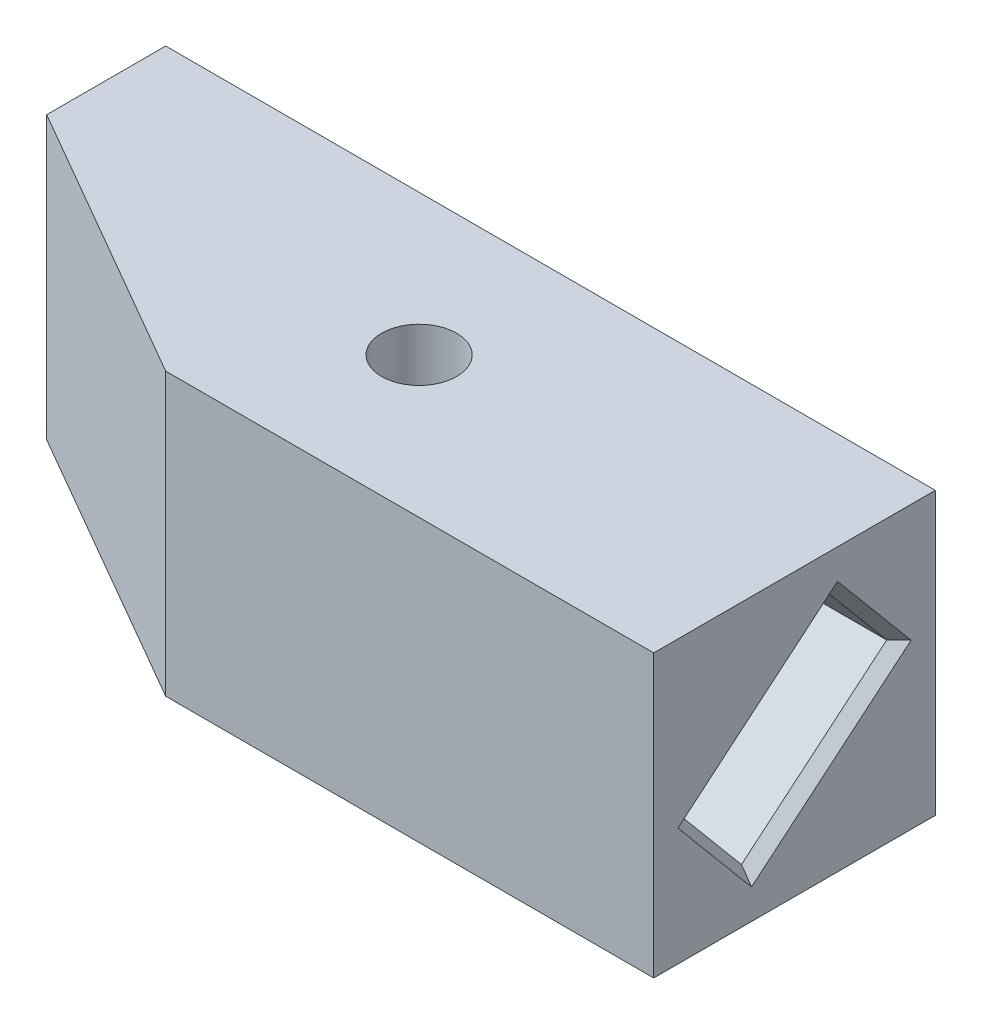
ISO-10303-21;
HEADER;
FILE_DESCRIPTION(('STEP AP214'),'2;1');
FILE_NAME('part.step','',(''),(''),'','','');
FILE_SCHEMA(('AUTOMOTIVE_DESIGN { 1 0 10303 214 1 1 1 1 }'));
ENDSEC;
DATA;
#1=APPLICATION_CONTEXT('core data for automotive mechanical design processes');
#2=APPLICATION_PROTOCOL_DEFINITION('international standard','automotive_design',2000,#1);
#3=PRODUCT_CONTEXT('',#1,'mechanical');
#4=PRODUCT('Part','Part','',(#3));
#5=PRODUCT_RELATED_PRODUCT_CATEGORY('part','',(#4));
#6=PRODUCT_DEFINITION_FORMATION('','',#4);
#7=PRODUCT_DEFINITION_CONTEXT('part definition',#1,'design');
#8=PRODUCT_DEFINITION('design','',#6,#7);
#9=PRODUCT_DEFINITION_SHAPE('','',#8);
#10=(LENGTH_UNIT() NAMED_UNIT(*) SI_UNIT(.MILLI.,.METRE.));
#11=(NAMED_UNIT(*) PLANE_ANGLE_UNIT() SI_UNIT($,.RADIAN.));
#12=(NAMED_UNIT(*) SI_UNIT($,.STERADIAN.) SOLID_ANGLE_UNIT());
#13=UNCERTAINTY_MEASURE_WITH_UNIT(LENGTH_MEASURE(1.E-05),#10,'distance_accuracy_value','');
#14=(GEOMETRIC_REPRESENTATION_CONTEXT(3) GLOBAL_UNCERTAINTY_ASSIGNED_CONTEXT((#13)) GLOBAL_UNIT_ASSIGNED_CONTEXT((#10,
#11,#12)) REPRESENTATION_CONTEXT('',''));
#15=CARTESIAN_POINT('',(0.,0.,0.));
#16=DIRECTION('',(0.,0.,1.));
#17=DIRECTION('',(1.,0.,0.));
#18=AXIS2_PLACEMENT_3D('',#15,#16,#17);
#19=CARTESIAN_POINT('',(20.,30.,15.));
#20=DIRECTION('',(-1.,0.,0.));
#21=DIRECTION('',(0.,0.,1.));
#22=AXIS2_PLACEMENT_3D('',#19,#20,#21);
#23=PLANE('',#22);
#24=DIRECTION('',(0.,-0.642787609686535,0.766044443118982));
#25=VECTOR('',#24,1.);
#26=CARTESIAN_POINT('',(20.,9.13870941688059,-2.50470123417735));
#27=LINE('',#26,#25);
#28=CARTESIAN_POINT('',(20.,17.4620713644947,-12.4240977377086));
#29=VERTEX_POINT('',#28);
#30=CARTESIAN_POINT('',(20.,3.19218642945365,4.58208889953283));
#31=VERTEX_POINT('',#30);
#32=EDGE_CURVE('E201',#29,#31,#27,.T.);
#33=ORIENTED_EDGE('',*,*,#32,.T.);
#34=DIRECTION('',(0.,0.766044443118982,0.642787609686535));
#35=VECTOR('',#34,1.);
#36=CARTESIAN_POINT('',(20.,24.0534770125731,22.0867901337102));
#37=LINE('',#36,#35);
#38=CARTESIAN_POINT('',(20.,12.5379286355053,12.4240977377086));
#39=VERTEX_POINT('',#38);
#40=EDGE_CURVE('E203',#31,#39,#37,.T.);
#41=ORIENTED_EDGE('',*,*,#40,.T.);
#42=DIRECTION('',(0.,0.642787609686535,-0.766044443118982));
#43=VECTOR('',#42,1.);
#44=CARTESIAN_POINT('',(20.,18.4844516229322,5.33730760399839));
#45=LINE('',#44,#43);
#46=CARTESIAN_POINT('',(20.,26.8078135705463,-4.58208889953283));
#47=VERTEX_POINT('',#46);
#48=EDGE_CURVE('E197',#39,#47,#45,.T.);
#49=ORIENTED_EDGE('',*,*,#48,.T.);
#50=DIRECTION('',(0.,-0.766044443118982,-0.642787609686535));
#51=VECTOR('',#50,1.);
#52=CARTESIAN_POINT('',(20.,38.3233619476141,5.08060349646879));
#53=LINE('',#52,#51);
#54=EDGE_CURVE('E199',#47,#29,#53,.T.);
#55=ORIENTED_EDGE('',*,*,#54,.T.);
#56=EDGE_LOOP('',(#33,#41,#49,#55));
#57=FACE_BOUND('',#56,.T.);
#58=DIRECTION('',(0.,0.,-1.));
#59=VECTOR('',#58,1.);
#60=CARTESIAN_POINT('',(20.,0.,15.));
#61=LINE('',#60,#59);
#62=CARTESIAN_POINT('',(20.,0.,15.));
#63=VERTEX_POINT('',#62);
#64=CARTESIAN_POINT('',(20.,0.,-15.));
#65=VERTEX_POINT('',#64);
#66=EDGE_CURVE('E172',#63,#65,#61,.T.);
#67=ORIENTED_EDGE('',*,*,#66,.T.);
#68=DIRECTION('',(0.,-1.,0.));
#69=VECTOR('',#68,1.);
#70=CARTESIAN_POINT('',(20.,30.,-15.));
#71=LINE('',#70,#69);
#72=CARTESIAN_POINT('',(20.,30.,-15.));
#73=VERTEX_POINT('',#72);
#74=EDGE_CURVE('E185',#73,#65,#71,.T.);
#75=ORIENTED_EDGE('',*,*,#74,.F.);
#76=DIRECTION('',(0.,0.,-1.));
#77=VECTOR('',#76,1.);
#78=CARTESIAN_POINT('',(20.,30.,15.));
#79=LINE('',#78,#77);
#80=CARTESIAN_POINT('',(20.,30.,15.));
#81=VERTEX_POINT('',#80);
#82=EDGE_CURVE('E135',#81,#73,#79,.T.);
#83=ORIENTED_EDGE('',*,*,#82,.F.);
#84=DIRECTION('',(0.,-1.,0.));
#85=VECTOR('',#84,1.);
#86=CARTESIAN_POINT('',(20.,30.,15.));
#87=LINE('',#86,#85);
#88=EDGE_CURVE('E178',#81,#63,#87,.T.);
#89=ORIENTED_EDGE('',*,*,#88,.T.);
#90=EDGE_LOOP('',(#67,#75,#83,#89));
#91=FACE_BOUND('',#90,.T.);
#92=ADVANCED_FACE('F35',(#57,#91),#23,.F.);
#93=CARTESIAN_POINT('',(-20.,30.,-15.));
#94=DIRECTION('',(0.,0.,1.));
#95=DIRECTION('',(1.,0.,0.));
#96=AXIS2_PLACEMENT_3D('',#93,#94,#95);
#97=PLANE('',#96);
#98=DIRECTION('',(-1.,0.,0.));
#99=VECTOR('',#98,1.);
#100=CARTESIAN_POINT('',(-20.,0.,-15.));
#101=LINE('',#100,#99);
#102=CARTESIAN_POINT('',(-62.,0.,-15.));
#103=VERTEX_POINT('',#102);
#104=EDGE_CURVE('E142',#65,#103,#101,.T.);
#105=ORIENTED_EDGE('',*,*,#104,.T.);
#106=DIRECTION('',(0.,-1.,0.));
#107=VECTOR('',#106,1.);
#108=CARTESIAN_POINT('',(-62.,0.,-15.));
#109=LINE('',#108,#107);
#110=CARTESIAN_POINT('',(-62.,30.,-15.));
#111=VERTEX_POINT('',#110);
#112=EDGE_CURVE('E125',#111,#103,#109,.T.);
#113=ORIENTED_EDGE('',*,*,#112,.F.);
#114=DIRECTION('',(-1.,0.,0.));
#115=VECTOR('',#114,1.);
#116=CARTESIAN_POINT('',(-20.,30.,-15.));
#117=LINE('',#116,#115);
#118=EDGE_CURVE('E132',#73,#111,#117,.T.);
#119=ORIENTED_EDGE('',*,*,#118,.F.);
#120=ORIENTED_EDGE('',*,*,#74,.T.);
#121=EDGE_LOOP('',(#105,#113,#119,#120));
#122=FACE_BOUND('',#121,.T.);
#123=ADVANCED_FACE('F141',(#122),#97,.F.);
#124=CARTESIAN_POINT('',(-20.,30.,15.));
#125=DIRECTION('',(0.,0.,-1.));
#126=DIRECTION('',(-1.,0.,0.));
#127=AXIS2_PLACEMENT_3D('',#124,#125,#126);
#128=PLANE('',#127);
#129=DIRECTION('',(1.,0.,0.));
#130=VECTOR('',#129,1.);
#131=CARTESIAN_POINT('',(-35.,30.,15.));
#132=LINE('',#131,#130);
#133=CARTESIAN_POINT('',(-31.9999999999998,30.,15.));
#134=VERTEX_POINT('',#133);
#135=EDGE_CURVE('E139',#134,#81,#132,.T.);
#136=ORIENTED_EDGE('',*,*,#135,.F.);
#137=DIRECTION('',(0.,-1.,0.));
#138=VECTOR('',#137,1.);
#139=CARTESIAN_POINT('',(-31.9999999999998,30.,15.));
#140=LINE('',#139,#138);
#141=CARTESIAN_POINT('',(-31.9999999999998,0.,15.));
#142=VERTEX_POINT('',#141);
#143=EDGE_CURVE('E190',#134,#142,#140,.T.);
#144=ORIENTED_EDGE('',*,*,#143,.T.);
#145=DIRECTION('',(1.,0.,0.));
#146=VECTOR('',#145,1.);
#147=CARTESIAN_POINT('',(-20.,0.,15.));
#148=LINE('',#147,#146);
#149=EDGE_CURVE('E175',#142,#63,#148,.T.);
#150=ORIENTED_EDGE('',*,*,#149,.T.);
#151=ORIENTED_EDGE('',*,*,#88,.F.);
#152=EDGE_LOOP('',(#136,#144,#150,#151));
#153=FACE_BOUND('',#152,.T.);
#154=ADVANCED_FACE('F261',(#153),#128,.F.);
#155=CARTESIAN_POINT('',(0.,30.,0.));
#156=DIRECTION('',(0.,-1.,0.));
#157=DIRECTION('',(0.,0.,-1.));
#158=AXIS2_PLACEMENT_3D('',#155,#156,#157);
#159=PLANE('',#158);
#160=CARTESIAN_POINT('',(-20.,30.,0.));
#161=DIRECTION('',(0.,1.,0.));
#162=DIRECTION('',(0.,0.,1.));
#163=AXIS2_PLACEMENT_3D('',#160,#161,#162);
#164=CIRCLE('',#163,4.);
#165=CARTESIAN_POINT('',(-20.,30.,4.));
#166=VERTEX_POINT('',#165);
#167=EDGE_CURVE('E162',#166,#166,#164,.T.);
#168=ORIENTED_EDGE('',*,*,#167,.F.);
#169=EDGE_LOOP('',(#168));
#170=FACE_BOUND('',#169,.T.);
#171=DIRECTION('',(0.,0.,-1.));
#172=VECTOR('',#171,1.);
#173=CARTESIAN_POINT('',(-62.,30.,-15.));
#174=LINE('',#173,#172);
#175=CARTESIAN_POINT('',(-62.,30.,-2.32050807568879));
#176=VERTEX_POINT('',#175);
#177=EDGE_CURVE('E120',#176,#111,#174,.T.);
#178=ORIENTED_EDGE('',*,*,#177,.F.);
#179=DIRECTION('',(-0.86602540378444,0.,-0.499999999999998));
#180=VECTOR('',#179,1.);
#181=CARTESIAN_POINT('',(-62.,30.,-2.32050807568879));
#182=LINE('',#181,#180);
#183=EDGE_CURVE('E188',#176,#134,#182,.F.);
#184=ORIENTED_EDGE('',*,*,#183,.T.);
#185=ORIENTED_EDGE('',*,*,#135,.T.);
#186=ORIENTED_EDGE('',*,*,#82,.T.);
#187=ORIENTED_EDGE('',*,*,#118,.T.);
#188=EDGE_LOOP('',(#178,#184,#185,#186,#187));
#189=FACE_BOUND('',#188,.T.);
#190=ADVANCED_FACE('F133',(#170,#189),#159,.F.);
#191=CARTESIAN_POINT('',(0.,0.,0.));
#192=DIRECTION('',(0.,-1.,0.));
#193=DIRECTION('',(0.,0.,-1.));
#194=AXIS2_PLACEMENT_3D('',#191,#192,#193);
#195=PLANE('',#194);
#196=CARTESIAN_POINT('',(-20.,0.,0.));
#197=DIRECTION('',(0.,1.,0.));
#198=DIRECTION('',(0.,0.,1.));
#199=AXIS2_PLACEMENT_3D('',#196,#197,#198);
#200=CIRCLE('',#199,4.);
#201=CARTESIAN_POINT('',(-20.,0.,4.));
#202=VERTEX_POINT('',#201);
#203=EDGE_CURVE('E169',#202,#202,#200,.T.);
#204=ORIENTED_EDGE('',*,*,#203,.T.);
#205=EDGE_LOOP('',(#204));
#206=FACE_BOUND('',#205,.T.);
#207=ORIENTED_EDGE('',*,*,#149,.F.);
#208=DIRECTION('',(0.86602540378444,0.,0.499999999999998));
#209=VECTOR('',#208,1.);
#210=CARTESIAN_POINT('',(-14.4951905283832,0.,25.1064064605509));
#211=LINE('',#210,#209);
#212=CARTESIAN_POINT('',(-62.,0.,-2.32050807568879));
#213=VERTEX_POINT('',#212);
#214=EDGE_CURVE('E192',#142,#213,#211,.F.);
#215=ORIENTED_EDGE('',*,*,#214,.T.);
#216=DIRECTION('',(0.,0.,1.));
#217=VECTOR('',#216,1.);
#218=CARTESIAN_POINT('',(-62.,0.,-15.));
#219=LINE('',#218,#217);
#220=EDGE_CURVE('E143',#103,#213,#219,.T.);
#221=ORIENTED_EDGE('',*,*,#220,.F.);
#222=ORIENTED_EDGE('',*,*,#104,.F.);
#223=ORIENTED_EDGE('',*,*,#66,.F.);
#224=EDGE_LOOP('',(#207,#215,#221,#222,#223));
#225=FACE_BOUND('',#224,.T.);
#226=ADVANCED_FACE('F325',(#206,#225),#195,.T.);
#227=CARTESIAN_POINT('',(-20.,0.,0.));
#228=DIRECTION('',(0.,1.,0.));
#229=DIRECTION('',(0.,0.,1.));
#230=AXIS2_PLACEMENT_3D('',#227,#228,#229);
#231=CYLINDRICAL_SURFACE('',#230,4.);
#232=ORIENTED_EDGE('',*,*,#203,.F.);
#233=EDGE_LOOP('',(#232));
#234=FACE_BOUND('',#233,.T.);
#235=ORIENTED_EDGE('',*,*,#167,.T.);
#236=EDGE_LOOP('',(#235));
#237=FACE_BOUND('',#236,.T.);
#238=ADVANCED_FACE('F252',(#234,#237),#231,.F.);
#239=CARTESIAN_POINT('',(-10.,25.3989815177408,-4.45883206610039));
#240=DIRECTION('',(0.,0.766044443118982,0.642787609686535));
#241=DIRECTION('',(0.,-0.642787609686535,0.766044443118982));
#242=AXIS2_PLACEMENT_3D('',#239,#240,#241);
#243=PLANE('',#242);
#244=DIRECTION('',(1.,0.,0.));
#245=VECTOR('',#244,1.);
#246=CARTESIAN_POINT('',(-10.,25.3989815177408,-4.45883206610039));
#247=LINE('',#246,#245);
#248=CARTESIAN_POINT('',(-10.,25.3989815177408,-4.45883206610039));
#249=VERTEX_POINT('',#248);
#250=CARTESIAN_POINT('',(18.8082464074058,25.3989815177408,-4.45883206610039));
#251=VERTEX_POINT('',#250);
#252=EDGE_CURVE('E160',#249,#251,#247,.T.);
#253=ORIENTED_EDGE('',*,*,#252,.T.);
#254=DIRECTION('',(0.,-0.642787609686535,0.766044443118982));
#255=VECTOR('',#254,1.);
#256=CARTESIAN_POINT('',(18.8082464074058,25.3989815177408,-4.45883206610039));
#257=LINE('',#256,#255);
#258=CARTESIAN_POINT('',(18.8082464074058,12.4146718020728,11.015265684903));
#259=VERTEX_POINT('',#258);
#260=EDGE_CURVE('E11',#251,#259,#257,.T.);
#261=ORIENTED_EDGE('',*,*,#260,.T.);
#262=DIRECTION('',(1.,0.,0.));
#263=VECTOR('',#262,1.);
#264=CARTESIAN_POINT('',(-10.,12.4146718020728,11.015265684903));
#265=LINE('',#264,#263);
#266=CARTESIAN_POINT('',(-10.,12.4146718020728,11.015265684903));
#267=VERTEX_POINT('',#266);
#268=EDGE_CURVE('E159',#267,#259,#265,.T.);
#269=ORIENTED_EDGE('',*,*,#268,.F.);
#270=DIRECTION('',(0.,-0.642787609686535,0.766044443118982));
#271=VECTOR('',#270,1.);
#272=CARTESIAN_POINT('',(-10.,25.3989815177408,-4.45883206610039));
#273=LINE('',#272,#271);
#274=EDGE_CURVE('E145',#249,#267,#273,.T.);
#275=ORIENTED_EDGE('',*,*,#274,.F.);
#276=EDGE_LOOP('',(#253,#261,#269,#275));
#277=FACE_BOUND('',#276,.T.);
#278=ADVANCED_FACE('F243',(#277),#243,.F.);
#279=CARTESIAN_POINT('',(-10.,17.5853281979272,-11.015265684903));
#280=DIRECTION('',(0.,0.642787609686535,-0.766044443118982));
#281=DIRECTION('',(0.,0.766044443118982,0.642787609686535));
#282=AXIS2_PLACEMENT_3D('',#279,#280,#281);
#283=PLANE('',#282);
#284=DIRECTION('',(1.,0.,0.));
#285=VECTOR('',#284,1.);
#286=CARTESIAN_POINT('',(-10.,17.5853281979272,-11.015265684903));
#287=LINE('',#286,#285);
#288=CARTESIAN_POINT('',(-10.,17.5853281979272,-11.015265684903));
#289=VERTEX_POINT('',#288);
#290=CARTESIAN_POINT('',(18.8082464074058,17.5853281979272,-11.015265684903));
#291=VERTEX_POINT('',#290);
#292=EDGE_CURVE('E163',#289,#291,#287,.T.);
#293=ORIENTED_EDGE('',*,*,#292,.T.);
#294=DIRECTION('',(0.,0.766044443118982,0.642787609686535));
#295=VECTOR('',#294,1.);
#296=CARTESIAN_POINT('',(18.8082464074058,17.5853281979272,-11.015265684903));
#297=LINE('',#296,#295);
#298=EDGE_CURVE('E44',#291,#251,#297,.T.);
#299=ORIENTED_EDGE('',*,*,#298,.T.);
#300=ORIENTED_EDGE('',*,*,#252,.F.);
#301=DIRECTION('',(0.,0.766044443118982,0.642787609686535));
#302=VECTOR('',#301,1.);
#303=CARTESIAN_POINT('',(-10.,17.5853281979272,-11.015265684903));
#304=LINE('',#303,#302);
#305=EDGE_CURVE('E156',#289,#249,#304,.T.);
#306=ORIENTED_EDGE('',*,*,#305,.F.);
#307=EDGE_LOOP('',(#293,#299,#300,#306));
#308=FACE_BOUND('',#307,.T.);
#309=ADVANCED_FACE('F244',(#308),#283,.F.);
#310=CARTESIAN_POINT('',(-10.,17.5853281979272,-11.015265684903));
#311=DIRECTION('',(0.,-0.766044443118982,-0.642787609686535));
#312=DIRECTION('',(0.,0.642787609686535,-0.766044443118982));
#313=AXIS2_PLACEMENT_3D('',#310,#311,#312);
#314=PLANE('',#313);
#315=DIRECTION('',(1.,0.,0.));
#316=VECTOR('',#315,1.);
#317=CARTESIAN_POINT('',(-10.,4.60101848225919,4.45883206610038));
#318=LINE('',#317,#316);
#319=CARTESIAN_POINT('',(-10.,4.60101848225919,4.45883206610038));
#320=VERTEX_POINT('',#319);
#321=CARTESIAN_POINT('',(18.8082464074058,4.60101848225919,4.45883206610038));
#322=VERTEX_POINT('',#321);
#323=EDGE_CURVE('E165',#320,#322,#318,.T.);
#324=ORIENTED_EDGE('',*,*,#323,.T.);
#325=DIRECTION('',(0.,0.642787609686535,-0.766044443118982));
#326=VECTOR('',#325,1.);
#327=CARTESIAN_POINT('',(18.8082464074058,17.5853281979272,-11.015265684903));
#328=LINE('',#327,#326);
#329=EDGE_CURVE('E59',#322,#291,#328,.T.);
#330=ORIENTED_EDGE('',*,*,#329,.T.);
#331=ORIENTED_EDGE('',*,*,#292,.F.);
#332=DIRECTION('',(0.,0.642787609686535,-0.766044443118982));
#333=VECTOR('',#332,1.);
#334=CARTESIAN_POINT('',(-10.,17.5853281979272,-11.015265684903));
#335=LINE('',#334,#333);
#336=EDGE_CURVE('E153',#320,#289,#335,.T.);
#337=ORIENTED_EDGE('',*,*,#336,.F.);
#338=EDGE_LOOP('',(#324,#330,#331,#337));
#339=FACE_BOUND('',#338,.T.);
#340=ADVANCED_FACE('F237',(#339),#314,.F.);
#341=CARTESIAN_POINT('',(-10.,4.60101848225919,4.45883206610038));
#342=DIRECTION('',(0.,-0.642787609686535,0.766044443118982));
#343=DIRECTION('',(0.,-0.766044443118982,-0.642787609686535));
#344=AXIS2_PLACEMENT_3D('',#341,#342,#343);
#345=PLANE('',#344);
#346=ORIENTED_EDGE('',*,*,#268,.T.);
#347=DIRECTION('',(0.,-0.766044443118982,-0.642787609686535));
#348=VECTOR('',#347,1.);
#349=CARTESIAN_POINT('',(18.8082464074058,4.60101848225919,4.45883206610038));
#350=LINE('',#349,#348);
#351=EDGE_CURVE('E194',#259,#322,#350,.T.);
#352=ORIENTED_EDGE('',*,*,#351,.T.);
#353=ORIENTED_EDGE('',*,*,#323,.F.);
#354=DIRECTION('',(0.,-0.766044443118982,-0.642787609686535));
#355=VECTOR('',#354,1.);
#356=CARTESIAN_POINT('',(-10.,4.60101848225919,4.45883206610038));
#357=LINE('',#356,#355);
#358=EDGE_CURVE('E150',#267,#320,#357,.T.);
#359=ORIENTED_EDGE('',*,*,#358,.F.);
#360=EDGE_LOOP('',(#346,#352,#353,#359));
#361=FACE_BOUND('',#360,.T.);
#362=ADVANCED_FACE('F234',(#361),#345,.F.);
#363=CARTESIAN_POINT('',(-10.,0.,0.));
#364=DIRECTION('',(-1.,0.,0.));
#365=DIRECTION('',(0.,0.,1.));
#366=AXIS2_PLACEMENT_3D('',#363,#364,#365);
#367=PLANE('',#366);
#368=ORIENTED_EDGE('',*,*,#274,.T.);
#369=ORIENTED_EDGE('',*,*,#358,.T.);
#370=ORIENTED_EDGE('',*,*,#336,.T.);
#371=ORIENTED_EDGE('',*,*,#305,.T.);
#372=EDGE_LOOP('',(#368,#369,#370,#371));
#373=FACE_BOUND('',#372,.T.);
#374=ADVANCED_FACE('F240',(#373),#367,.F.);
#375=CARTESIAN_POINT('',(-62.,0.,0.));
#376=DIRECTION('',(1.,0.,0.));
#377=DIRECTION('',(0.,0.,-1.));
#378=AXIS2_PLACEMENT_3D('',#375,#376,#377);
#379=PLANE('',#378);
#380=ORIENTED_EDGE('',*,*,#220,.T.);
#381=DIRECTION('',(0.,1.,0.));
#382=VECTOR('',#381,1.);
#383=CARTESIAN_POINT('',(-62.,0.,-2.32050807568879));
#384=LINE('',#383,#382);
#385=EDGE_CURVE('E128',#213,#176,#384,.T.);
#386=ORIENTED_EDGE('',*,*,#385,.T.);
#387=ORIENTED_EDGE('',*,*,#177,.T.);
#388=ORIENTED_EDGE('',*,*,#112,.T.);
#389=EDGE_LOOP('',(#380,#386,#387,#388));
#390=FACE_BOUND('',#389,.T.);
#391=ADVANCED_FACE('F123',(#390),#379,.F.);
#392=CARTESIAN_POINT('',(-62.,0.,-2.32050807568879));
#393=DIRECTION('',(0.499999999999998,0.,-0.86602540378444));
#394=DIRECTION('',(0.,1.,0.));
#395=AXIS2_PLACEMENT_3D('',#392,#393,#394);
#396=PLANE('',#395);
#397=ORIENTED_EDGE('',*,*,#214,.F.);
#398=ORIENTED_EDGE('',*,*,#143,.F.);
#399=ORIENTED_EDGE('',*,*,#183,.F.);
#400=ORIENTED_EDGE('',*,*,#385,.F.);
#401=EDGE_LOOP('',(#397,#398,#399,#400));
#402=FACE_BOUND('',#401,.T.);
#403=ADVANCED_FACE('F265',(#402),#396,.F.);
#404=CARTESIAN_POINT('',(18.8082464074058,17.5853281979272,-11.015265684903));
#405=DIRECTION('',(-0.64278760968654,0.4924038765061,-0.586824088833467));
#406=DIRECTION('',(0.,0.766044443118982,0.642787609686535));
#407=AXIS2_PLACEMENT_3D('',#404,#405,#406);
#408=PLANE('',#407);
#409=DIRECTION('',(0.644400477571769,-0.06664696697491,-0.761778318343546));
#410=VECTOR('',#409,1.);
#411=CARTESIAN_POINT('',(18.8082464074058,17.5853281979272,-11.015265684903));
#412=LINE('',#411,#410);
#413=EDGE_CURVE('E211',#29,#291,#412,.F.);
#414=ORIENTED_EDGE('',*,*,#413,.F.);
#415=ORIENTED_EDGE('',*,*,#54,.F.);
#416=DIRECTION('',(0.644400477571769,0.761778318343546,-0.066646966974904));
#417=VECTOR('',#416,1.);
#418=CARTESIAN_POINT('',(15.2541810566765,21.1975415430783,-4.09125369783277));
#419=LINE('',#418,#417);
#420=EDGE_CURVE('E39',#251,#47,#419,.T.);
#421=ORIENTED_EDGE('',*,*,#420,.F.);
#422=ORIENTED_EDGE('',*,*,#298,.F.);
#423=EDGE_LOOP('',(#414,#415,#421,#422));
#424=FACE_BOUND('',#423,.T.);
#425=ADVANCED_FACE('F37',(#424),#408,.F.);
#426=CARTESIAN_POINT('',(18.8082464074058,25.3989815177408,-4.45883206610039));
#427=DIRECTION('',(-0.642787609686543,0.586824088833465,0.492403876506099));
#428=DIRECTION('',(0.,-0.642787609686535,0.766044443118982));
#429=AXIS2_PLACEMENT_3D('',#426,#427,#428);
#430=PLANE('',#429);
#431=ORIENTED_EDGE('',*,*,#420,.T.);
#432=ORIENTED_EDGE('',*,*,#48,.F.);
#433=DIRECTION('',(-0.644400477571768,-0.0666469669749081,-0.761778318343547));
#434=VECTOR('',#433,1.);
#435=CARTESIAN_POINT('',(15.2541810566765,12.0470934338052,6.81382571024056));
#436=LINE('',#435,#434);
#437=EDGE_CURVE('E210',#259,#39,#436,.F.);
#438=ORIENTED_EDGE('',*,*,#437,.F.);
#439=ORIENTED_EDGE('',*,*,#260,.F.);
#440=EDGE_LOOP('',(#431,#432,#438,#439));
#441=FACE_BOUND('',#440,.T.);
#442=ADVANCED_FACE('F221',(#441),#430,.F.);
#443=CARTESIAN_POINT('',(18.8082464074058,17.5853281979272,-11.015265684903));
#444=DIRECTION('',(-0.642787609686543,-0.586824088833465,-0.492403876506098));
#445=DIRECTION('',(0.,0.642787609686535,-0.766044443118982));
#446=AXIS2_PLACEMENT_3D('',#443,#444,#445);
#447=PLANE('',#446);
#448=ORIENTED_EDGE('',*,*,#413,.T.);
#449=ORIENTED_EDGE('',*,*,#329,.F.);
#450=DIRECTION('',(0.644400477571768,-0.761778318343547,0.0666469669749063));
#451=VECTOR('',#450,1.);
#452=CARTESIAN_POINT('',(18.8082464074058,4.60101848225919,4.45883206610038));
#453=LINE('',#452,#451);
#454=EDGE_CURVE('E208',#31,#322,#453,.F.);
#455=ORIENTED_EDGE('',*,*,#454,.F.);
#456=ORIENTED_EDGE('',*,*,#32,.F.);
#457=EDGE_LOOP('',(#448,#449,#455,#456));
#458=FACE_BOUND('',#457,.T.);
#459=ADVANCED_FACE('F232',(#458),#447,.F.);
#460=CARTESIAN_POINT('',(18.8082464074058,4.60101848225919,4.45883206610038));
#461=DIRECTION('',(-0.642787609686542,-0.492403876506099,0.586824088833466));
#462=DIRECTION('',(0.,-0.766044443118982,-0.642787609686535));
#463=AXIS2_PLACEMENT_3D('',#460,#461,#462);
#464=PLANE('',#463);
#465=ORIENTED_EDGE('',*,*,#437,.T.);
#466=ORIENTED_EDGE('',*,*,#40,.F.);
#467=ORIENTED_EDGE('',*,*,#454,.T.);
#468=ORIENTED_EDGE('',*,*,#351,.F.);
#469=EDGE_LOOP('',(#465,#466,#467,#468));
#470=FACE_BOUND('',#469,.T.);
#471=ADVANCED_FACE('F230',(#470),#464,.F.);
#472=CLOSED_SHELL('',(#92,#123,#154,#190,#226,#238,#278,#309,#340,#362,#374,#391,#403,#425,#442,
#459,#471));
#473=MANIFOLD_SOLID_BREP('B2',#472);
#474=ADVANCED_BREP_SHAPE_REPRESENTATION('',(#18,#473),#14);
#475=SHAPE_DEFINITION_REPRESENTATION(#9,#474);
ENDSEC;
END-ISO-10303-21;
